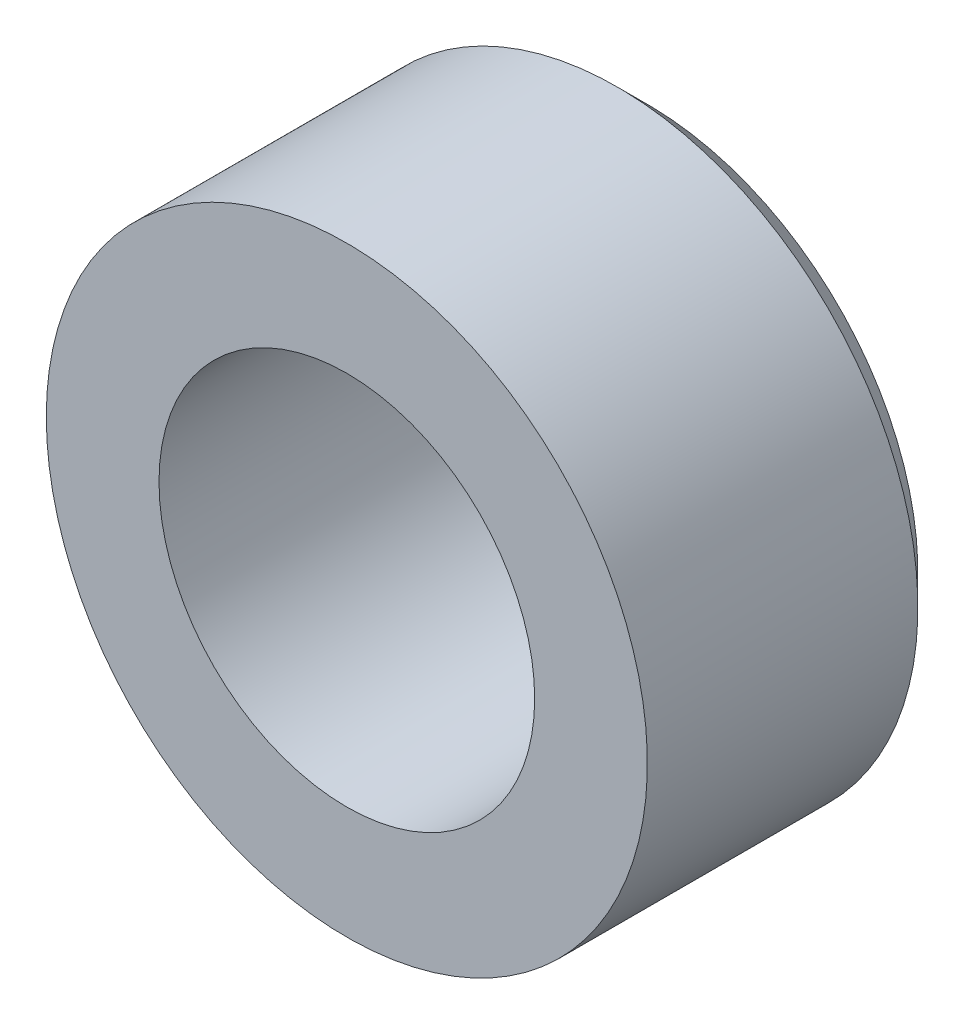
ISO-10303-21;
HEADER;
FILE_DESCRIPTION(('STEP AP214'),'2;1');
FILE_NAME('part.step','',(''),(''),'','','');
FILE_SCHEMA(('AUTOMOTIVE_DESIGN { 1 0 10303 214 1 1 1 1 }'));
ENDSEC;
DATA;
#1=APPLICATION_CONTEXT('core data for automotive mechanical design processes');
#2=APPLICATION_PROTOCOL_DEFINITION('international standard','automotive_design',2000,#1);
#3=PRODUCT_CONTEXT('',#1,'mechanical');
#4=PRODUCT('Part','Part','',(#3));
#5=PRODUCT_RELATED_PRODUCT_CATEGORY('part','',(#4));
#6=PRODUCT_DEFINITION_FORMATION('','',#4);
#7=PRODUCT_DEFINITION_CONTEXT('part definition',#1,'design');
#8=PRODUCT_DEFINITION('design','',#6,#7);
#9=PRODUCT_DEFINITION_SHAPE('','',#8);
#10=(LENGTH_UNIT() NAMED_UNIT(*) SI_UNIT(.MILLI.,.METRE.));
#11=(NAMED_UNIT(*) PLANE_ANGLE_UNIT() SI_UNIT($,.RADIAN.));
#12=(NAMED_UNIT(*) SI_UNIT($,.STERADIAN.) SOLID_ANGLE_UNIT());
#13=UNCERTAINTY_MEASURE_WITH_UNIT(LENGTH_MEASURE(1.E-05),#10,'distance_accuracy_value','');
#14=(GEOMETRIC_REPRESENTATION_CONTEXT(3) GLOBAL_UNCERTAINTY_ASSIGNED_CONTEXT((#13)) GLOBAL_UNIT_ASSIGNED_CONTEXT((#10,
#11,#12)) REPRESENTATION_CONTEXT('',''));
#15=CARTESIAN_POINT('',(0.,0.,0.));
#16=DIRECTION('',(0.,0.,1.));
#17=DIRECTION('',(1.,0.,0.));
#18=AXIS2_PLACEMENT_3D('',#15,#16,#17);
#19=CARTESIAN_POINT('',(0.,-34.,15.));
#20=DIRECTION('',(0.,0.,-1.));
#21=DIRECTION('',(-1.,0.,0.));
#22=AXIS2_PLACEMENT_3D('',#19,#20,#21);
#23=CYLINDRICAL_SURFACE('',#22,20.);
#24=CARTESIAN_POINT('',(0.,-34.,-3.));
#25=DIRECTION('',(0.,0.,-1.));
#26=DIRECTION('',(-1.,0.,0.));
#27=AXIS2_PLACEMENT_3D('',#24,#25,#26);
#28=CIRCLE('',#27,20.);
#29=CARTESIAN_POINT('',(-20.,-34.,-3.));
#30=VERTEX_POINT('',#29);
#31=EDGE_CURVE('E10',#30,#30,#28,.F.);
#32=ORIENTED_EDGE('',*,*,#31,.T.);
#33=EDGE_LOOP('',(#32));
#34=FACE_BOUND('',#33,.T.);
#35=CARTESIAN_POINT('',(0.,-34.,15.));
#36=DIRECTION('',(0.,0.,-1.));
#37=DIRECTION('',(-1.,0.,0.));
#38=AXIS2_PLACEMENT_3D('',#35,#36,#37);
#39=CIRCLE('',#38,20.);
#40=CARTESIAN_POINT('',(-20.,-34.,15.));
#41=VERTEX_POINT('',#40);
#42=EDGE_CURVE('E64',#41,#41,#39,.T.);
#43=ORIENTED_EDGE('',*,*,#42,.T.);
#44=EDGE_LOOP('',(#43));
#45=FACE_BOUND('',#44,.T.);
#46=ADVANCED_FACE('F38',(#34,#45),#23,.T.);
#47=CARTESIAN_POINT('',(0.,-34.,15.));
#48=DIRECTION('',(0.,0.,-1.));
#49=DIRECTION('',(-1.,0.,0.));
#50=AXIS2_PLACEMENT_3D('',#47,#48,#49);
#51=PLANE('',#50);
#52=CARTESIAN_POINT('',(0.,-34.,15.));
#53=DIRECTION('',(0.,0.,-1.));
#54=DIRECTION('',(-1.,0.,0.));
#55=AXIS2_PLACEMENT_3D('',#52,#53,#54);
#56=CIRCLE('',#55,12.5);
#57=CARTESIAN_POINT('',(-12.5,-34.,15.));
#58=VERTEX_POINT('',#57);
#59=EDGE_CURVE('E68',#58,#58,#56,.T.);
#60=ORIENTED_EDGE('',*,*,#59,.T.);
#61=EDGE_LOOP('',(#60));
#62=FACE_BOUND('',#61,.T.);
#63=ORIENTED_EDGE('',*,*,#42,.F.);
#64=EDGE_LOOP('',(#63));
#65=FACE_BOUND('',#64,.T.);
#66=ADVANCED_FACE('F74',(#62,#65),#51,.F.);
#67=CARTESIAN_POINT('',(0.,-34.,-5.));
#68=DIRECTION('',(0.,0.,-1.));
#69=DIRECTION('',(-1.,0.,0.));
#70=AXIS2_PLACEMENT_3D('',#67,#68,#69);
#71=PLANE('',#70);
#72=CARTESIAN_POINT('',(0.,-34.,-5.));
#73=DIRECTION('',(0.,0.,-1.));
#74=DIRECTION('',(-1.,0.,0.));
#75=AXIS2_PLACEMENT_3D('',#72,#73,#74);
#76=CIRCLE('',#75,18.);
#77=CARTESIAN_POINT('',(-18.,-34.,-5.));
#78=VERTEX_POINT('',#77);
#79=EDGE_CURVE('E46',#78,#78,#76,.T.);
#80=ORIENTED_EDGE('',*,*,#79,.T.);
#81=EDGE_LOOP('',(#80));
#82=FACE_BOUND('',#81,.T.);
#83=CARTESIAN_POINT('',(0.,-34.,-5.));
#84=DIRECTION('',(0.,0.,-1.));
#85=DIRECTION('',(-1.,0.,0.));
#86=AXIS2_PLACEMENT_3D('',#83,#84,#85);
#87=CIRCLE('',#86,14.5);
#88=CARTESIAN_POINT('',(-14.5,-34.,-5.));
#89=VERTEX_POINT('',#88);
#90=EDGE_CURVE('E52',#89,#89,#87,.F.);
#91=ORIENTED_EDGE('',*,*,#90,.T.);
#92=EDGE_LOOP('',(#91));
#93=FACE_BOUND('',#92,.T.);
#94=ADVANCED_FACE('F80',(#82,#93),#71,.T.);
#95=CARTESIAN_POINT('',(0.,-34.,15.));
#96=DIRECTION('',(0.,0.,-1.));
#97=DIRECTION('',(-1.,0.,0.));
#98=AXIS2_PLACEMENT_3D('',#95,#96,#97);
#99=CYLINDRICAL_SURFACE('',#98,12.5);
#100=CARTESIAN_POINT('',(0.,-34.,-3.));
#101=DIRECTION('',(0.,0.,-1.));
#102=DIRECTION('',(-1.,0.,0.));
#103=AXIS2_PLACEMENT_3D('',#100,#101,#102);
#104=CIRCLE('',#103,12.5);
#105=CARTESIAN_POINT('',(-12.5,-34.,-3.));
#106=VERTEX_POINT('',#105);
#107=EDGE_CURVE('E58',#106,#106,#104,.T.);
#108=ORIENTED_EDGE('',*,*,#107,.T.);
#109=EDGE_LOOP('',(#108));
#110=FACE_BOUND('',#109,.T.);
#111=ORIENTED_EDGE('',*,*,#59,.F.);
#112=EDGE_LOOP('',(#111));
#113=FACE_BOUND('',#112,.T.);
#114=ADVANCED_FACE('F77',(#110,#113),#99,.F.);
#115=CARTESIAN_POINT('',(0.,-34.,-3.));
#116=DIRECTION('',(0.,0.,-1.));
#117=DIRECTION('',(-1.,0.,0.));
#118=AXIS2_PLACEMENT_3D('',#115,#116,#117);
#119=CONICAL_SURFACE('',#118,12.5,0.785398163397449);
#120=ORIENTED_EDGE('',*,*,#90,.F.);
#121=EDGE_LOOP('',(#120));
#122=FACE_BOUND('',#121,.T.);
#123=ORIENTED_EDGE('',*,*,#107,.F.);
#124=EDGE_LOOP('',(#123));
#125=FACE_BOUND('',#124,.T.);
#126=ADVANCED_FACE('F79',(#122,#125),#119,.F.);
#127=CARTESIAN_POINT('',(0.,-34.,-5.));
#128=DIRECTION('',(0.,0.,1.));
#129=DIRECTION('',(1.,0.,0.));
#130=AXIS2_PLACEMENT_3D('',#127,#128,#129);
#131=CONICAL_SURFACE('',#130,18.,0.785398163397447);
#132=ORIENTED_EDGE('',*,*,#31,.F.);
#133=EDGE_LOOP('',(#132));
#134=FACE_BOUND('',#133,.T.);
#135=ORIENTED_EDGE('',*,*,#79,.F.);
#136=EDGE_LOOP('',(#135));
#137=FACE_BOUND('',#136,.T.);
#138=ADVANCED_FACE('F40',(#134,#137),#131,.T.);
#139=CLOSED_SHELL('',(#46,#66,#94,#114,#126,#138));
#140=MANIFOLD_SOLID_BREP('B2',#139);
#141=ADVANCED_BREP_SHAPE_REPRESENTATION('',(#18,#140),#14);
#142=SHAPE_DEFINITION_REPRESENTATION(#9,#141);
ENDSEC;
END-ISO-10303-21;
